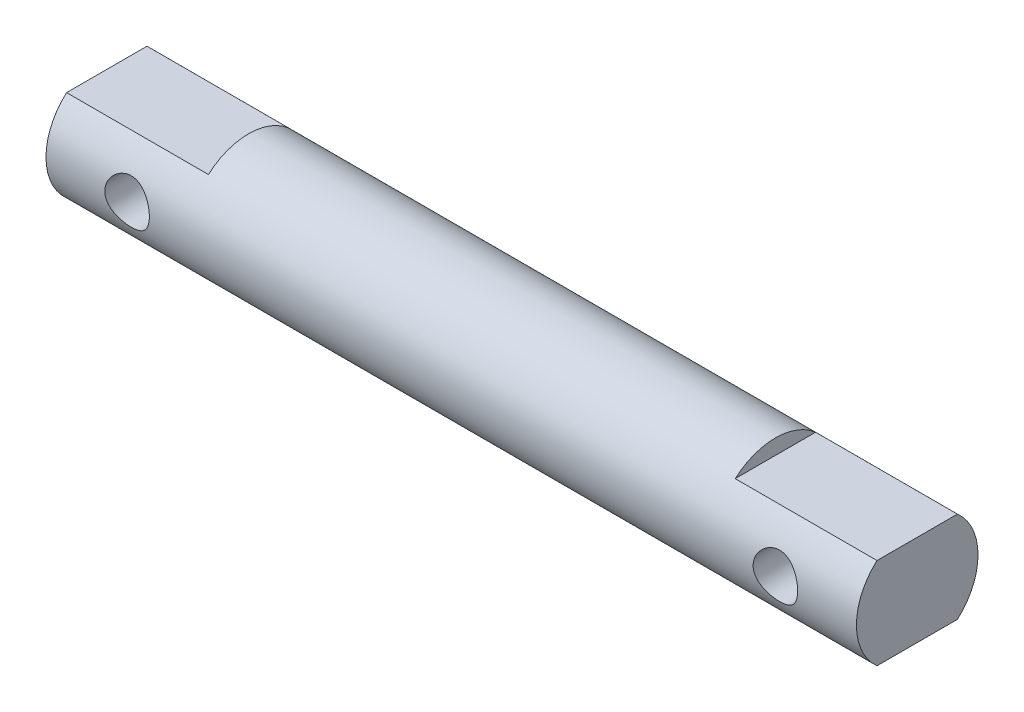
ISO-10303-21;
HEADER;
FILE_DESCRIPTION(('STEP AP214'),'2;1');
FILE_NAME('part.step','',(''),(''),'','','');
FILE_SCHEMA(('AUTOMOTIVE_DESIGN { 1 0 10303 214 1 1 1 1 }'));
ENDSEC;
DATA;
#1=APPLICATION_CONTEXT('core data for automotive mechanical design processes');
#2=APPLICATION_PROTOCOL_DEFINITION('international standard','automotive_design',2000,#1);
#3=PRODUCT_CONTEXT('',#1,'mechanical');
#4=PRODUCT('Part','Part','',(#3));
#5=PRODUCT_RELATED_PRODUCT_CATEGORY('part','',(#4));
#6=PRODUCT_DEFINITION_FORMATION('','',#4);
#7=PRODUCT_DEFINITION_CONTEXT('part definition',#1,'design');
#8=PRODUCT_DEFINITION('design','',#6,#7);
#9=PRODUCT_DEFINITION_SHAPE('','',#8);
#10=(LENGTH_UNIT() NAMED_UNIT(*) SI_UNIT(.MILLI.,.METRE.));
#11=(NAMED_UNIT(*) PLANE_ANGLE_UNIT() SI_UNIT($,.RADIAN.));
#12=(NAMED_UNIT(*) SI_UNIT($,.STERADIAN.) SOLID_ANGLE_UNIT());
#13=UNCERTAINTY_MEASURE_WITH_UNIT(LENGTH_MEASURE(1.E-05),#10,'distance_accuracy_value','');
#14=(GEOMETRIC_REPRESENTATION_CONTEXT(3) GLOBAL_UNCERTAINTY_ASSIGNED_CONTEXT((#13)) GLOBAL_UNIT_ASSIGNED_CONTEXT((#10,
#11,#12)) REPRESENTATION_CONTEXT('',''));
#15=CARTESIAN_POINT('',(0.,0.,0.));
#16=DIRECTION('',(0.,0.,1.));
#17=DIRECTION('',(1.,0.,0.));
#18=AXIS2_PLACEMENT_3D('',#15,#16,#17);
#19=CARTESIAN_POINT('',(-20.,3.,0.));
#20=DIRECTION('',(1.,0.,0.));
#21=DIRECTION('',(0.,0.,-1.));
#22=AXIS2_PLACEMENT_3D('',#19,#20,#21);
#23=PLANE('',#22);
#24=CARTESIAN_POINT('',(-20.,0.,0.));
#25=DIRECTION('',(-1.,0.,0.));
#26=DIRECTION('',(0.,0.,1.));
#27=AXIS2_PLACEMENT_3D('',#24,#25,#26);
#28=CIRCLE('',#27,3.);
#29=CARTESIAN_POINT('',(-20.,2.25,-1.98431348329845));
#30=VERTEX_POINT('',#29);
#31=CARTESIAN_POINT('',(-20.,-2.25,-1.98431348329845));
#32=VERTEX_POINT('',#31);
#33=EDGE_CURVE('E176',#30,#32,#28,.T.);
#34=ORIENTED_EDGE('',*,*,#33,.T.);
#35=DIRECTION('',(0.,0.,1.));
#36=VECTOR('',#35,1.);
#37=CARTESIAN_POINT('',(-20.,-2.25,-3.));
#38=LINE('',#37,#36);
#39=CARTESIAN_POINT('',(-20.,-2.25,1.98431348329845));
#40=VERTEX_POINT('',#39);
#41=EDGE_CURVE('E177',#32,#40,#38,.T.);
#42=ORIENTED_EDGE('',*,*,#41,.T.);
#43=CARTESIAN_POINT('',(-20.,2.25,1.98431348329845));
#44=VERTEX_POINT('',#43);
#45=EDGE_CURVE('E185',#40,#44,#28,.T.);
#46=ORIENTED_EDGE('',*,*,#45,.T.);
#47=DIRECTION('',(0.,0.,1.));
#48=VECTOR('',#47,1.);
#49=CARTESIAN_POINT('',(-20.,2.25,-3.));
#50=LINE('',#49,#48);
#51=EDGE_CURVE('E180',#30,#44,#50,.T.);
#52=ORIENTED_EDGE('',*,*,#51,.F.);
#53=EDGE_LOOP('',(#34,#42,#46,#52));
#54=FACE_BOUND('',#53,.T.);
#55=ADVANCED_FACE('F31',(#54),#23,.F.);
#56=CARTESIAN_POINT('',(20.,3.,0.));
#57=DIRECTION('',(-1.,0.,0.));
#58=DIRECTION('',(0.,0.,1.));
#59=AXIS2_PLACEMENT_3D('',#56,#57,#58);
#60=PLANE('',#59);
#61=CARTESIAN_POINT('',(20.,0.,0.));
#62=DIRECTION('',(-1.,0.,0.));
#63=DIRECTION('',(0.,0.,1.));
#64=AXIS2_PLACEMENT_3D('',#61,#62,#63);
#65=CIRCLE('',#64,3.);
#66=CARTESIAN_POINT('',(20.,-2.25,1.98431348329845));
#67=VERTEX_POINT('',#66);
#68=CARTESIAN_POINT('',(20.,2.25,1.98431348329845));
#69=VERTEX_POINT('',#68);
#70=EDGE_CURVE('E184',#67,#69,#65,.T.);
#71=ORIENTED_EDGE('',*,*,#70,.F.);
#72=DIRECTION('',(0.,0.,1.));
#73=VECTOR('',#72,1.);
#74=CARTESIAN_POINT('',(20.,-2.24999999999999,-3.));
#75=LINE('',#74,#73);
#76=CARTESIAN_POINT('',(20.,-2.24999999999999,-1.98431348329845));
#77=VERTEX_POINT('',#76);
#78=EDGE_CURVE('E49',#77,#67,#75,.T.);
#79=ORIENTED_EDGE('',*,*,#78,.F.);
#80=CARTESIAN_POINT('',(20.,2.25,-1.98431348329845));
#81=VERTEX_POINT('',#80);
#82=EDGE_CURVE('E115',#81,#77,#65,.T.);
#83=ORIENTED_EDGE('',*,*,#82,.F.);
#84=DIRECTION('',(0.,0.,1.));
#85=VECTOR('',#84,1.);
#86=CARTESIAN_POINT('',(20.,2.25,-3.));
#87=LINE('',#86,#85);
#88=EDGE_CURVE('E57',#81,#69,#87,.T.);
#89=ORIENTED_EDGE('',*,*,#88,.T.);
#90=EDGE_LOOP('',(#71,#79,#83,#89));
#91=FACE_BOUND('',#90,.T.);
#92=ADVANCED_FACE('F166',(#91),#60,.F.);
#93=CARTESIAN_POINT('',(0.,0.,0.));
#94=DIRECTION('',(-1.,0.,0.));
#95=DIRECTION('',(0.,0.,1.));
#96=AXIS2_PLACEMENT_3D('',#93,#94,#95);
#97=CYLINDRICAL_SURFACE('',#96,3.);
#98=CARTESIAN_POINT('',(17.1,0.,-3.));
#99=CARTESIAN_POINT('',(17.1000016959377,0.0596653603658475,-3.00000124874777));
#100=CARTESIAN_POINT('',(17.0951301942859,0.119318861047392,-2.99820433362878));
#101=CARTESIAN_POINT('',(17.0758476944229,0.236848244255451,-2.99121508676533));
#102=CARTESIAN_POINT('',(17.0614376008315,0.294724294806991,-2.98602307700504));
#103=CARTESIAN_POINT('',(17.0236525816176,0.40698713855009,-2.97280239953096));
#104=CARTESIAN_POINT('',(17.0002944784406,0.461380257103498,-2.96477905699958));
#105=CARTESIAN_POINT('',(16.9453600789518,0.56547335680578,-2.94669890184719));
#106=CARTESIAN_POINT('',(16.9137816850185,0.615172135653516,-2.93664157034718));
#107=CARTESIAN_POINT('',(16.8419533651427,0.710497168894281,-2.91507648167801));
#108=CARTESIAN_POINT('',(16.8014267972003,0.75590589164363,-2.90352893596448));
#109=CARTESIAN_POINT('',(16.7134398983826,0.839455790057789,-2.88048533673688));
#110=CARTESIAN_POINT('',(16.6659775853424,0.877594880931809,-2.86898929891451));
#111=CARTESIAN_POINT('',(16.563376148578,0.946876023491567,-2.84689276879725));
#112=CARTESIAN_POINT('',(16.5080218172978,0.977715943844815,-2.83633955824423));
#113=CARTESIAN_POINT('',(16.3924637493466,1.02955228614908,-2.81793972857027));
#114=CARTESIAN_POINT('',(16.3322618630331,1.0505524433536,-2.81009208269453));
#115=CARTESIAN_POINT('',(16.2112164474398,1.0812631510737,-2.798415961319));
#116=CARTESIAN_POINT('',(16.1504925023863,1.09138742706648,-2.79444077822037));
#117=CARTESIAN_POINT('',(16.0280875242816,1.10135267987145,-2.7905293041686));
#118=CARTESIAN_POINT('',(15.9664068739079,1.10119766744092,-2.79059143794103));
#119=CARTESIAN_POINT('',(15.8475684309638,1.09092609853663,-2.7946206462547));
#120=CARTESIAN_POINT('',(15.7903527714323,1.08137599754645,-2.79836566494697));
#121=CARTESIAN_POINT('',(15.6784010781988,1.05351920552002,-2.80897082219962));
#122=CARTESIAN_POINT('',(15.6236654025675,1.03521125437041,-2.81583140903281));
#123=CARTESIAN_POINT('',(15.5170456833763,0.990035328733108,-2.8320333504401));
#124=CARTESIAN_POINT('',(15.4652325623985,0.963016175829746,-2.84141799234525));
#125=CARTESIAN_POINT('',(15.3667082597295,0.901290064724288,-2.86159544268106));
#126=CARTESIAN_POINT('',(15.3199987915719,0.86658053627602,-2.87238872140381));
#127=CARTESIAN_POINT('',(15.2298618065168,0.78784062113783,-2.89501075010137));
#128=CARTESIAN_POINT('',(15.1868359200932,0.743355730941568,-2.90686155110834));
#129=CARTESIAN_POINT('',(15.1087384983429,0.647663117597076,-2.92966708861006));
#130=CARTESIAN_POINT('',(15.0736680803958,0.596454451658584,-2.94062169909304));
#131=CARTESIAN_POINT('',(15.0120600315232,0.487779773000808,-2.96060161705553));
#132=CARTESIAN_POINT('',(14.9856506658485,0.430235217521433,-2.96959731294347));
#133=CARTESIAN_POINT('',(14.9430190273705,0.311108672774422,-2.98442731277654));
#134=CARTESIAN_POINT('',(14.9267924370579,0.249528406901529,-2.99026295644358));
#135=CARTESIAN_POINT('',(14.9057463597197,0.127462862761649,-2.99788264484015));
#136=CARTESIAN_POINT('',(14.900385667251,0.0670827891130063,-2.99985872688891));
#137=CARTESIAN_POINT('',(14.8996547992509,-0.0537391869774858,-3.0001264355405));
#138=CARTESIAN_POINT('',(14.9042825233452,-0.114181073749809,-2.99841883675149));
#139=CARTESIAN_POINT('',(14.9229819168092,-0.231108406159618,-2.99163788470485));
#140=CARTESIAN_POINT('',(14.9367037311999,-0.287657784812599,-2.98668929450055));
#141=CARTESIAN_POINT('',(14.9727460210941,-0.397615636671328,-2.97404894323754));
#142=CARTESIAN_POINT('',(14.9950676153823,-0.451023700166589,-2.96635682527047));
#143=CARTESIAN_POINT('',(15.0483784353486,-0.554908427976737,-2.94871738617956));
#144=CARTESIAN_POINT('',(15.0795992520196,-0.605255980194477,-2.93871137811358));
#145=CARTESIAN_POINT('',(15.1495585567129,-0.700162701835578,-2.91755723487566));
#146=CARTESIAN_POINT('',(15.188299730741,-0.744719793590156,-2.90640869230438));
#147=CARTESIAN_POINT('',(15.274729050306,-0.829360890855199,-2.88343377289124));
#148=CARTESIAN_POINT('',(15.322794023905,-0.869060195620299,-2.87160406892303));
#149=CARTESIAN_POINT('',(15.4251419979686,-0.939899669781492,-2.84920568198054));
#150=CARTESIAN_POINT('',(15.4794254299312,-0.971039244708762,-2.83863708661841));
#151=CARTESIAN_POINT('',(15.5930149486137,-1.02386254843664,-2.8200170700311));
#152=CARTESIAN_POINT('',(15.6523338404576,-1.04552125182698,-2.81197232633534));
#153=CARTESIAN_POINT('',(15.7741515392404,-1.0784092993252,-2.79952649364981));
#154=CARTESIAN_POINT('',(15.8366484733941,-1.08964471233036,-2.79512328456104));
#155=CARTESIAN_POINT('',(15.9589005440155,-1.10083806784982,-2.79073255817453));
#156=CARTESIAN_POINT('',(16.0185873167862,-1.1014482886697,-2.79048965654101));
#157=CARTESIAN_POINT('',(16.1371646200869,-1.09303145247646,-2.7937971077441));
#158=CARTESIAN_POINT('',(16.1960552190201,-1.0840052287752,-2.79734713258729));
#159=CARTESIAN_POINT('',(16.3097076343864,-1.05707078841707,-2.80763225279226));
#160=CARTESIAN_POINT('',(16.3645387880301,-1.03941724094369,-2.81427578061567));
#161=CARTESIAN_POINT('',(16.4704956611847,-0.995949426173609,-2.82994981114228));
#162=CARTESIAN_POINT('',(16.5216204604584,-0.970133140652863,-2.83898090407659));
#163=CARTESIAN_POINT('',(16.62153059325,-0.909551414968637,-2.85898260515673));
#164=CARTESIAN_POINT('',(16.6700657713279,-0.874398504847364,-2.87002834990345));
#165=CARTESIAN_POINT('',(16.7607572977932,-0.796752399809456,-2.89254526375225));
#166=CARTESIAN_POINT('',(16.8029116572399,-0.75425692497287,-2.90401656412106));
#167=CARTESIAN_POINT('',(16.8818239918814,-0.660548639786973,-2.92679216754413));
#168=CARTESIAN_POINT('',(16.9181989614741,-0.609002616112059,-2.93805837226636));
#169=CARTESIAN_POINT('',(16.9817509381987,-0.500136860580023,-2.95853467976325));
#170=CARTESIAN_POINT('',(17.00892790779,-0.44281710515934,-2.96774477414609));
#171=CARTESIAN_POINT('',(17.0536679906505,-0.322493606369644,-2.9832468592136));
#172=CARTESIAN_POINT('',(17.0709760902518,-0.259384186418022,-2.9894608548018));
#173=CARTESIAN_POINT('',(17.0941386087502,-0.130844392872351,-2.99783583601898));
#174=CARTESIAN_POINT('',(17.0999981406317,-0.0654150686575986,-2.99999863091548));
#175=CARTESIAN_POINT('',(17.1,0.,-3.));
#176=B_SPLINE_CURVE_WITH_KNOTS('',3,(#98,#99,#100,#101,#102,#103,#104,#105,#106,#107,#108,#109,
#110,#111,#112,#113,#114,#115,#116,#117,#118,#119,#120,#121,#122,#123,#124,#125,#126,#127,#128,
#129,#130,#131,#132,#133,#134,#135,#136,#137,#138,#139,#140,#141,#142,#143,#144,#145,#146,#147,
#148,#149,#150,#151,#152,#153,#154,#155,#156,#157,#158,#159,#160,#161,#162,#163,#164,#165,#166,
#167,#168,#169,#170,#171,#172,#173,#174,#175),.UNSPECIFIED.,.T.,.F.,(4,2,2,2,2,2,2,2,2,2,2,2,2,
2,2,2,2,2,2,2,2,2,2,2,2,2,2,2,2,2,2,2,2,2,2,2,2,2,4),(0.,0.178754907739739,0.357492865169349,
0.535896427659754,0.714345559175,0.899369895863449,1.08444721440599,1.27620269157261,
1.46788531772088,1.65198550181501,1.83601385439912,2.00958682077848,2.18318476902303,
2.35997410918524,2.53682262453215,2.72499447820699,2.91319274508038,3.10406398185192,
3.29485423420864,3.47588192225445,3.65687154732447,3.83127381950643,4.00569878814084,
4.18515848390998,4.36468239466833,4.55415458027959,4.74363992131372,4.93362244947295,
5.12349429191199,5.3016658147168,5.4798219313811,5.65301061537201,5.82624215351945,
6.00825949460879,6.190333455313,6.38165835431486,6.57298403417707,6.76905241099166,
6.96503320271031),.UNSPECIFIED.);
#177=CARTESIAN_POINT('',(17.1,0.,-3.));
#178=VERTEX_POINT('',#177);
#179=EDGE_CURVE('E11',#178,#178,#176,.T.);
#180=ORIENTED_EDGE('',*,*,#179,.T.);
#181=EDGE_LOOP('',(#180));
#182=FACE_BOUND('',#181,.T.);
#183=CARTESIAN_POINT('',(17.1,0.,3.));
#184=CARTESIAN_POINT('',(17.1000016959377,-0.0596653603658475,3.00000124874777));
#185=CARTESIAN_POINT('',(17.0951301942859,-0.119318861047392,2.99820433362878));
#186=CARTESIAN_POINT('',(17.0758476944229,-0.236848244255451,2.99121508676533));
#187=CARTESIAN_POINT('',(17.0614376008315,-0.294724294806991,2.98602307700504));
#188=CARTESIAN_POINT('',(17.0236525816176,-0.40698713855009,2.97280239953096));
#189=CARTESIAN_POINT('',(17.0002944784406,-0.461380257103498,2.96477905699958));
#190=CARTESIAN_POINT('',(16.9453600789518,-0.56547335680578,2.94669890184719));
#191=CARTESIAN_POINT('',(16.9137816850185,-0.615172135653516,2.93664157034718));
#192=CARTESIAN_POINT('',(16.8419533651427,-0.710497168894281,2.91507648167801));
#193=CARTESIAN_POINT('',(16.8014267972003,-0.75590589164363,2.90352893596448));
#194=CARTESIAN_POINT('',(16.7134398983826,-0.839455790057789,2.88048533673688));
#195=CARTESIAN_POINT('',(16.6659775853424,-0.877594880931809,2.86898929891451));
#196=CARTESIAN_POINT('',(16.563376148578,-0.946876023491567,2.84689276879725));
#197=CARTESIAN_POINT('',(16.5080218172978,-0.977715943844815,2.83633955824423));
#198=CARTESIAN_POINT('',(16.3924637493466,-1.02955228614908,2.81793972857027));
#199=CARTESIAN_POINT('',(16.3322618630331,-1.0505524433536,2.81009208269453));
#200=CARTESIAN_POINT('',(16.2112164474398,-1.0812631510737,2.798415961319));
#201=CARTESIAN_POINT('',(16.1504925023863,-1.09138742706648,2.79444077822037));
#202=CARTESIAN_POINT('',(16.0280875242816,-1.10135267987145,2.7905293041686));
#203=CARTESIAN_POINT('',(15.9664068739079,-1.10119766744092,2.79059143794103));
#204=CARTESIAN_POINT('',(15.8475684309638,-1.09092609853663,2.7946206462547));
#205=CARTESIAN_POINT('',(15.7903527714323,-1.08137599754645,2.79836566494697));
#206=CARTESIAN_POINT('',(15.6784010781988,-1.05351920552002,2.80897082219962));
#207=CARTESIAN_POINT('',(15.6236654025675,-1.03521125437041,2.81583140903281));
#208=CARTESIAN_POINT('',(15.5170456833763,-0.990035328733108,2.8320333504401));
#209=CARTESIAN_POINT('',(15.4652325623985,-0.963016175829746,2.84141799234525));
#210=CARTESIAN_POINT('',(15.3667082597295,-0.901290064724288,2.86159544268106));
#211=CARTESIAN_POINT('',(15.3199987915719,-0.86658053627602,2.87238872140381));
#212=CARTESIAN_POINT('',(15.2298618065168,-0.78784062113783,2.89501075010137));
#213=CARTESIAN_POINT('',(15.1868359200932,-0.743355730941568,2.90686155110834));
#214=CARTESIAN_POINT('',(15.1087384983429,-0.647663117597076,2.92966708861006));
#215=CARTESIAN_POINT('',(15.0736680803958,-0.596454451658584,2.94062169909304));
#216=CARTESIAN_POINT('',(15.0120600315232,-0.487779773000808,2.96060161705553));
#217=CARTESIAN_POINT('',(14.9856506658485,-0.430235217521433,2.96959731294347));
#218=CARTESIAN_POINT('',(14.9430190273705,-0.311108672774422,2.98442731277654));
#219=CARTESIAN_POINT('',(14.9267924370579,-0.249528406901529,2.99026295644358));
#220=CARTESIAN_POINT('',(14.9057463597197,-0.127462862761649,2.99788264484015));
#221=CARTESIAN_POINT('',(14.900385667251,-0.0670827891130063,2.99985872688891));
#222=CARTESIAN_POINT('',(14.8996547992509,0.0537391869774858,3.0001264355405));
#223=CARTESIAN_POINT('',(14.9042825233452,0.114181073749809,2.99841883675149));
#224=CARTESIAN_POINT('',(14.9229819168092,0.231108406159618,2.99163788470485));
#225=CARTESIAN_POINT('',(14.9367037311999,0.287657784812599,2.98668929450055));
#226=CARTESIAN_POINT('',(14.9727460210941,0.397615636671328,2.97404894323754));
#227=CARTESIAN_POINT('',(14.9950676153823,0.451023700166589,2.96635682527047));
#228=CARTESIAN_POINT('',(15.0483784353486,0.554908427976737,2.94871738617956));
#229=CARTESIAN_POINT('',(15.0795992520196,0.605255980194477,2.93871137811358));
#230=CARTESIAN_POINT('',(15.1495585567129,0.700162701835578,2.91755723487566));
#231=CARTESIAN_POINT('',(15.188299730741,0.744719793590156,2.90640869230438));
#232=CARTESIAN_POINT('',(15.274729050306,0.829360890855199,2.88343377289124));
#233=CARTESIAN_POINT('',(15.322794023905,0.869060195620299,2.87160406892303));
#234=CARTESIAN_POINT('',(15.4251419979686,0.939899669781492,2.84920568198054));
#235=CARTESIAN_POINT('',(15.4794254299312,0.971039244708762,2.83863708661841));
#236=CARTESIAN_POINT('',(15.5930149486137,1.02386254843664,2.8200170700311));
#237=CARTESIAN_POINT('',(15.6523338404576,1.04552125182698,2.81197232633534));
#238=CARTESIAN_POINT('',(15.7741515392404,1.0784092993252,2.79952649364981));
#239=CARTESIAN_POINT('',(15.8366484733941,1.08964471233036,2.79512328456104));
#240=CARTESIAN_POINT('',(15.9589005440155,1.10083806784982,2.79073255817453));
#241=CARTESIAN_POINT('',(16.0185873167862,1.1014482886697,2.79048965654101));
#242=CARTESIAN_POINT('',(16.1371646200869,1.09303145247646,2.7937971077441));
#243=CARTESIAN_POINT('',(16.1960552190201,1.0840052287752,2.79734713258729));
#244=CARTESIAN_POINT('',(16.3097076343864,1.05707078841707,2.80763225279226));
#245=CARTESIAN_POINT('',(16.3645387880301,1.03941724094369,2.81427578061567));
#246=CARTESIAN_POINT('',(16.4704956611847,0.995949426173609,2.82994981114228));
#247=CARTESIAN_POINT('',(16.5216204604584,0.970133140652863,2.83898090407659));
#248=CARTESIAN_POINT('',(16.62153059325,0.909551414968637,2.85898260515673));
#249=CARTESIAN_POINT('',(16.6700657713279,0.874398504847364,2.87002834990345));
#250=CARTESIAN_POINT('',(16.7607572977932,0.796752399809456,2.89254526375225));
#251=CARTESIAN_POINT('',(16.8029116572399,0.75425692497287,2.90401656412106));
#252=CARTESIAN_POINT('',(16.8818239918814,0.660548639786973,2.92679216754413));
#253=CARTESIAN_POINT('',(16.9181989614741,0.609002616112059,2.93805837226636));
#254=CARTESIAN_POINT('',(16.9817509381987,0.500136860580023,2.95853467976325));
#255=CARTESIAN_POINT('',(17.00892790779,0.44281710515934,2.96774477414609));
#256=CARTESIAN_POINT('',(17.0536679906505,0.322493606369644,2.9832468592136));
#257=CARTESIAN_POINT('',(17.0709760902518,0.259384186418022,2.9894608548018));
#258=CARTESIAN_POINT('',(17.0941386087502,0.130844392872351,2.99783583601898));
#259=CARTESIAN_POINT('',(17.0999981406317,0.0654150686575986,2.99999863091548));
#260=CARTESIAN_POINT('',(17.1,0.,3.));
#261=B_SPLINE_CURVE_WITH_KNOTS('',3,(#183,#184,#185,#186,#187,#188,#189,#190,#191,#192,#193,
#194,#195,#196,#197,#198,#199,#200,#201,#202,#203,#204,#205,#206,#207,#208,#209,#210,#211,#212,
#213,#214,#215,#216,#217,#218,#219,#220,#221,#222,#223,#224,#225,#226,#227,#228,#229,#230,#231,
#232,#233,#234,#235,#236,#237,#238,#239,#240,#241,#242,#243,#244,#245,#246,#247,#248,#249,#250,
#251,#252,#253,#254,#255,#256,#257,#258,#259,#260),.UNSPECIFIED.,.T.,.F.,(4,2,2,2,2,2,2,2,2,2,2,
2,2,2,2,2,2,2,2,2,2,2,2,2,2,2,2,2,2,2,2,2,2,2,2,2,2,2,4),(0.,0.178754907739739,
0.357492865169349,0.535896427659754,0.714345559175,0.899369895863449,1.08444721440599,
1.27620269157261,1.46788531772088,1.65198550181501,1.83601385439912,2.00958682077848,
2.18318476902303,2.35997410918524,2.53682262453215,2.72499447820699,2.91319274508038,
3.10406398185192,3.29485423420864,3.47588192225445,3.65687154732447,3.83127381950643,
4.00569878814084,4.18515848390998,4.36468239466833,4.55415458027959,4.74363992131372,
4.93362244947295,5.12349429191199,5.3016658147168,5.4798219313811,5.65301061537201,
5.82624215351945,6.00825949460879,6.190333455313,6.38165835431486,6.57298403417707,
6.76905241099166,6.96503320271031),.UNSPECIFIED.);
#262=CARTESIAN_POINT('',(17.1,0.,3.));
#263=VERTEX_POINT('',#262);
#264=EDGE_CURVE('E42',#263,#263,#261,.T.);
#265=ORIENTED_EDGE('',*,*,#264,.T.);
#266=EDGE_LOOP('',(#265));
#267=FACE_BOUND('',#266,.T.);
#268=CARTESIAN_POINT('',(-14.9,0.,-3.));
#269=CARTESIAN_POINT('',(-14.8999983040623,0.0596653603658478,-3.00000124874777));
#270=CARTESIAN_POINT('',(-14.9048698057141,0.119318861047392,-2.99820433362878));
#271=CARTESIAN_POINT('',(-14.9241523055771,0.236848244255451,-2.99121508676533));
#272=CARTESIAN_POINT('',(-14.9385623991685,0.294724294806991,-2.98602307700504));
#273=CARTESIAN_POINT('',(-14.9763474183824,0.40698713855009,-2.97280239953095));
#274=CARTESIAN_POINT('',(-14.9997055215594,0.461380257103499,-2.96477905699958));
#275=CARTESIAN_POINT('',(-15.0546399210482,0.56547335680578,-2.94669890184719));
#276=CARTESIAN_POINT('',(-15.0862183149815,0.615172135653517,-2.93664157034718));
#277=CARTESIAN_POINT('',(-15.1580466348573,0.710497168894281,-2.91507648167801));
#278=CARTESIAN_POINT('',(-15.1985732027997,0.755905891643631,-2.90352893596448));
#279=CARTESIAN_POINT('',(-15.2865601016174,0.839455790057789,-2.88048533673688));
#280=CARTESIAN_POINT('',(-15.3340224146576,0.877594880931809,-2.86898929891451));
#281=CARTESIAN_POINT('',(-15.436623851422,0.946876023491567,-2.84689276879725));
#282=CARTESIAN_POINT('',(-15.4919781827022,0.977715943844814,-2.83633955824423));
#283=CARTESIAN_POINT('',(-15.6075362506534,1.02955228614908,-2.81793972857028));
#284=CARTESIAN_POINT('',(-15.6677381369669,1.0505524433536,-2.81009208269453));
#285=CARTESIAN_POINT('',(-15.7887835525602,1.0812631510737,-2.798415961319));
#286=CARTESIAN_POINT('',(-15.8495074976137,1.09138742706649,-2.79444077822037));
#287=CARTESIAN_POINT('',(-15.9719124757184,1.10135267987145,-2.7905293041686));
#288=CARTESIAN_POINT('',(-16.0335931260921,1.10119766744092,-2.79059143794103));
#289=CARTESIAN_POINT('',(-16.1524315690362,1.09092609853663,-2.7946206462547));
#290=CARTESIAN_POINT('',(-16.2096472285677,1.08137599754645,-2.79836566494697));
#291=CARTESIAN_POINT('',(-16.3215989218012,1.05351920552002,-2.80897082219962));
#292=CARTESIAN_POINT('',(-16.3763345974325,1.03521125437041,-2.81583140903281));
#293=CARTESIAN_POINT('',(-16.4829543166237,0.990035328733111,-2.8320333504401));
#294=CARTESIAN_POINT('',(-16.5347674376015,0.963016175829749,-2.84141799234525));
#295=CARTESIAN_POINT('',(-16.6332917402705,0.901290064724291,-2.86159544268106));
#296=CARTESIAN_POINT('',(-16.6800012084281,0.866580536276023,-2.87238872140381));
#297=CARTESIAN_POINT('',(-16.7701381934832,0.787840621137833,-2.89501075010137));
#298=CARTESIAN_POINT('',(-16.8131640799068,0.74335573094157,-2.90686155110834));
#299=CARTESIAN_POINT('',(-16.8912615016571,0.647663117597078,-2.92966708861006));
#300=CARTESIAN_POINT('',(-16.9263319196042,0.596454451658586,-2.94062169909304));
#301=CARTESIAN_POINT('',(-16.9879399684768,0.48777977300081,-2.96060161705553));
#302=CARTESIAN_POINT('',(-17.0143493341515,0.430235217521433,-2.96959731294347));
#303=CARTESIAN_POINT('',(-17.0569809726295,0.311108672774423,-2.98442731277654));
#304=CARTESIAN_POINT('',(-17.0732075629421,0.249528406901531,-2.99026295644358));
#305=CARTESIAN_POINT('',(-17.0942536402803,0.127462862761652,-2.99788264484015));
#306=CARTESIAN_POINT('',(-17.099614332749,0.0670827891130083,-2.99985872688891));
#307=CARTESIAN_POINT('',(-17.1003452007491,-0.0537391869774842,-3.0001264355405));
#308=CARTESIAN_POINT('',(-17.0957174766548,-0.114181073749807,-2.99841883675149));
#309=CARTESIAN_POINT('',(-17.0770180831908,-0.231108406159617,-2.99163788470485));
#310=CARTESIAN_POINT('',(-17.0632962688001,-0.287657784812599,-2.98668929450055));
#311=CARTESIAN_POINT('',(-17.0272539789059,-0.397615636671328,-2.97404894323754));
#312=CARTESIAN_POINT('',(-17.0049323846177,-0.451023700166588,-2.96635682527047));
#313=CARTESIAN_POINT('',(-16.9516215646514,-0.554908427976736,-2.94871738617956));
#314=CARTESIAN_POINT('',(-16.9204007479804,-0.605255980194477,-2.93871137811357));
#315=CARTESIAN_POINT('',(-16.8504414432871,-0.700162701835579,-2.91755723487566));
#316=CARTESIAN_POINT('',(-16.811700269259,-0.744719793590156,-2.90640869230438));
#317=CARTESIAN_POINT('',(-16.725270949694,-0.829360890855199,-2.88343377289124));
#318=CARTESIAN_POINT('',(-16.677205976095,-0.869060195620301,-2.87160406892303));
#319=CARTESIAN_POINT('',(-16.5748580020314,-0.939899669781493,-2.84920568198054));
#320=CARTESIAN_POINT('',(-16.5205745700688,-0.971039244708763,-2.83863708661841));
#321=CARTESIAN_POINT('',(-16.4069850513863,-1.02386254843665,-2.8200170700311));
#322=CARTESIAN_POINT('',(-16.3476661595424,-1.04552125182698,-2.81197232633534));
#323=CARTESIAN_POINT('',(-16.2258484607596,-1.0784092993252,-2.79952649364981));
#324=CARTESIAN_POINT('',(-16.1633515266059,-1.08964471233036,-2.79512328456104));
#325=CARTESIAN_POINT('',(-16.0410994559845,-1.10083806784982,-2.79073255817453));
#326=CARTESIAN_POINT('',(-15.9814126832138,-1.1014482886697,-2.79048965654101));
#327=CARTESIAN_POINT('',(-15.8628353799131,-1.09303145247646,-2.7937971077441));
#328=CARTESIAN_POINT('',(-15.8039447809799,-1.0840052287752,-2.79734713258729));
#329=CARTESIAN_POINT('',(-15.6902923656136,-1.05707078841707,-2.80763225279226));
#330=CARTESIAN_POINT('',(-15.6354612119699,-1.03941724094369,-2.81427578061567));
#331=CARTESIAN_POINT('',(-15.5295043388153,-0.995949426173611,-2.82994981114228));
#332=CARTESIAN_POINT('',(-15.4783795395416,-0.970133140652865,-2.83898090407659));
#333=CARTESIAN_POINT('',(-15.37846940675,-0.90955141496864,-2.85898260515673));
#334=CARTESIAN_POINT('',(-15.3299342286721,-0.874398504847367,-2.87002834990345));
#335=CARTESIAN_POINT('',(-15.2392427022068,-0.79675239980946,-2.89254526375225));
#336=CARTESIAN_POINT('',(-15.1970883427601,-0.754256924972873,-2.90401656412106));
#337=CARTESIAN_POINT('',(-15.1181760081186,-0.660548639786976,-2.92679216754413));
#338=CARTESIAN_POINT('',(-15.0818010385259,-0.609002616112063,-2.93805837226635));
#339=CARTESIAN_POINT('',(-15.0182490618013,-0.500136860580026,-2.95853467976325));
#340=CARTESIAN_POINT('',(-14.99107209221,-0.442817105159344,-2.96774477414609));
#341=CARTESIAN_POINT('',(-14.9463320093495,-0.322493606369647,-2.9832468592136));
#342=CARTESIAN_POINT('',(-14.9290239097482,-0.259384186418024,-2.9894608548018));
#343=CARTESIAN_POINT('',(-14.9058613912498,-0.130844392872352,-2.99783583601898));
#344=CARTESIAN_POINT('',(-14.9000018593683,-0.0654150686575992,-2.99999863091548));
#345=CARTESIAN_POINT('',(-14.9,0.,-3.));
#346=B_SPLINE_CURVE_WITH_KNOTS('',3,(#268,#269,#270,#271,#272,#273,#274,#275,#276,#277,#278,
#279,#280,#281,#282,#283,#284,#285,#286,#287,#288,#289,#290,#291,#292,#293,#294,#295,#296,#297,
#298,#299,#300,#301,#302,#303,#304,#305,#306,#307,#308,#309,#310,#311,#312,#313,#314,#315,#316,
#317,#318,#319,#320,#321,#322,#323,#324,#325,#326,#327,#328,#329,#330,#331,#332,#333,#334,#335,
#336,#337,#338,#339,#340,#341,#342,#343,#344,#345),.UNSPECIFIED.,.T.,.F.,(4,2,2,2,2,2,2,2,2,2,2,
2,2,2,2,2,2,2,2,2,2,2,2,2,2,2,2,2,2,2,2,2,2,2,2,2,2,2,4),(0.,0.178754907739739,
0.357492865169348,0.535896427659755,0.714345559175001,0.899369895863447,1.08444721440599,
1.2762026915726,1.46788531772088,1.65198550181501,1.83601385439912,2.00958682077848,
2.18318476902303,2.35997410918523,2.53682262453215,2.72499447820699,2.91319274508039,
3.10406398185192,3.29485423420864,3.47588192225445,3.65687154732447,3.83127381950643,
4.00569878814085,4.18515848390999,4.36468239466834,4.55415458027959,4.74363992131372,
4.93362244947296,5.123494291912,5.3016658147168,5.47982193138111,5.65301061537202,
5.82624215351945,6.00825949460879,6.19033345531301,6.38165835431487,6.57298403417708,
6.76905241099167,6.96503320271032),.UNSPECIFIED.);
#347=CARTESIAN_POINT('',(-14.9,0.,-3.));
#348=VERTEX_POINT('',#347);
#349=EDGE_CURVE('E119',#348,#348,#346,.T.);
#350=ORIENTED_EDGE('',*,*,#349,.T.);
#351=EDGE_LOOP('',(#350));
#352=FACE_BOUND('',#351,.T.);
#353=CARTESIAN_POINT('',(-14.9,0.,3.));
#354=CARTESIAN_POINT('',(-14.8999983040623,-0.0596653603658477,3.00000124874777));
#355=CARTESIAN_POINT('',(-14.9048698057141,-0.119318861047392,2.99820433362878));
#356=CARTESIAN_POINT('',(-14.9241523055771,-0.236848244255451,2.99121508676533));
#357=CARTESIAN_POINT('',(-14.9385623991685,-0.294724294806991,2.98602307700504));
#358=CARTESIAN_POINT('',(-14.9763474183824,-0.40698713855009,2.97280239953096));
#359=CARTESIAN_POINT('',(-14.9997055215594,-0.461380257103498,2.96477905699958));
#360=CARTESIAN_POINT('',(-15.0546399210482,-0.56547335680578,2.94669890184719));
#361=CARTESIAN_POINT('',(-15.0862183149815,-0.615172135653516,2.93664157034718));
#362=CARTESIAN_POINT('',(-15.1580466348573,-0.710497168894281,2.91507648167801));
#363=CARTESIAN_POINT('',(-15.1985732027997,-0.755905891643631,2.90352893596448));
#364=CARTESIAN_POINT('',(-15.2865601016174,-0.839455790057789,2.88048533673688));
#365=CARTESIAN_POINT('',(-15.3340224146576,-0.877594880931808,2.86898929891451));
#366=CARTESIAN_POINT('',(-15.436623851422,-0.946876023491567,2.84689276879725));
#367=CARTESIAN_POINT('',(-15.4919781827022,-0.977715943844815,2.83633955824423));
#368=CARTESIAN_POINT('',(-15.6075362506534,-1.02955228614908,2.81793972857027));
#369=CARTESIAN_POINT('',(-15.6677381369669,-1.0505524433536,2.81009208269453));
#370=CARTESIAN_POINT('',(-15.7887835525602,-1.0812631510737,2.798415961319));
#371=CARTESIAN_POINT('',(-15.8495074976137,-1.09138742706649,2.79444077822037));
#372=CARTESIAN_POINT('',(-15.9719124757184,-1.10135267987145,2.7905293041686));
#373=CARTESIAN_POINT('',(-16.0335931260921,-1.10119766744092,2.79059143794103));
#374=CARTESIAN_POINT('',(-16.1524315690362,-1.09092609853663,2.7946206462547));
#375=CARTESIAN_POINT('',(-16.2096472285677,-1.08137599754645,2.79836566494697));
#376=CARTESIAN_POINT('',(-16.3215989218012,-1.05351920552002,2.80897082219962));
#377=CARTESIAN_POINT('',(-16.3763345974325,-1.03521125437041,2.81583140903281));
#378=CARTESIAN_POINT('',(-16.4829543166237,-0.990035328733111,2.8320333504401));
#379=CARTESIAN_POINT('',(-16.5347674376015,-0.96301617582975,2.84141799234525));
#380=CARTESIAN_POINT('',(-16.6332917402705,-0.901290064724291,2.86159544268105));
#381=CARTESIAN_POINT('',(-16.6800012084281,-0.866580536276023,2.87238872140381));
#382=CARTESIAN_POINT('',(-16.7701381934832,-0.787840621137832,2.89501075010137));
#383=CARTESIAN_POINT('',(-16.8131640799068,-0.743355730941569,2.90686155110834));
#384=CARTESIAN_POINT('',(-16.8912615016571,-0.647663117597078,2.92966708861006));
#385=CARTESIAN_POINT('',(-16.9263319196042,-0.596454451658586,2.94062169909304));
#386=CARTESIAN_POINT('',(-16.9879399684768,-0.487779773000809,2.96060161705553));
#387=CARTESIAN_POINT('',(-17.0143493341515,-0.430235217521432,2.96959731294347));
#388=CARTESIAN_POINT('',(-17.0569809726295,-0.311108672774422,2.98442731277654));
#389=CARTESIAN_POINT('',(-17.0732075629421,-0.24952840690153,2.99026295644358));
#390=CARTESIAN_POINT('',(-17.0942536402803,-0.127462862761651,2.99788264484015));
#391=CARTESIAN_POINT('',(-17.099614332749,-0.0670827891130074,2.99985872688891));
#392=CARTESIAN_POINT('',(-17.1003452007491,0.0537391869774854,3.0001264355405));
#393=CARTESIAN_POINT('',(-17.0957174766548,0.114181073749808,2.99841883675149));
#394=CARTESIAN_POINT('',(-17.0770180831908,0.231108406159618,2.99163788470485));
#395=CARTESIAN_POINT('',(-17.0632962688001,0.287657784812599,2.98668929450055));
#396=CARTESIAN_POINT('',(-17.0272539789059,0.397615636671328,2.97404894323754));
#397=CARTESIAN_POINT('',(-17.0049323846177,0.451023700166589,2.96635682527047));
#398=CARTESIAN_POINT('',(-16.9516215646514,0.554908427976737,2.94871738617956));
#399=CARTESIAN_POINT('',(-16.9204007479804,0.605255980194477,2.93871137811357));
#400=CARTESIAN_POINT('',(-16.8504414432871,0.700162701835579,2.91755723487566));
#401=CARTESIAN_POINT('',(-16.811700269259,0.744719793590157,2.90640869230438));
#402=CARTESIAN_POINT('',(-16.725270949694,0.8293608908552,2.88343377289124));
#403=CARTESIAN_POINT('',(-16.677205976095,0.869060195620301,2.87160406892303));
#404=CARTESIAN_POINT('',(-16.5748580020314,0.939899669781493,2.84920568198054));
#405=CARTESIAN_POINT('',(-16.5205745700688,0.971039244708763,2.83863708661841));
#406=CARTESIAN_POINT('',(-16.4069850513863,1.02386254843665,2.8200170700311));
#407=CARTESIAN_POINT('',(-16.3476661595424,1.04552125182698,2.81197232633534));
#408=CARTESIAN_POINT('',(-16.2258484607596,1.0784092993252,2.79952649364981));
#409=CARTESIAN_POINT('',(-16.1633515266059,1.08964471233036,2.79512328456104));
#410=CARTESIAN_POINT('',(-16.0410994559845,1.10083806784982,2.79073255817453));
#411=CARTESIAN_POINT('',(-15.9814126832138,1.1014482886697,2.79048965654101));
#412=CARTESIAN_POINT('',(-15.8628353799131,1.09303145247646,2.7937971077441));
#413=CARTESIAN_POINT('',(-15.8039447809799,1.0840052287752,2.79734713258729));
#414=CARTESIAN_POINT('',(-15.6902923656136,1.05707078841707,2.80763225279226));
#415=CARTESIAN_POINT('',(-15.6354612119699,1.03941724094369,2.81427578061567));
#416=CARTESIAN_POINT('',(-15.5295043388153,0.995949426173611,2.82994981114228));
#417=CARTESIAN_POINT('',(-15.4783795395416,0.970133140652865,2.83898090407659));
#418=CARTESIAN_POINT('',(-15.37846940675,0.90955141496864,2.85898260515673));
#419=CARTESIAN_POINT('',(-15.3299342286721,0.874398504847367,2.87002834990345));
#420=CARTESIAN_POINT('',(-15.2392427022068,0.796752399809459,2.89254526375225));
#421=CARTESIAN_POINT('',(-15.1970883427601,0.754256924972873,2.90401656412106));
#422=CARTESIAN_POINT('',(-15.1181760081186,0.660548639786976,2.92679216754413));
#423=CARTESIAN_POINT('',(-15.0818010385259,0.609002616112063,2.93805837226635));
#424=CARTESIAN_POINT('',(-15.0182490618013,0.500136860580026,2.95853467976325));
#425=CARTESIAN_POINT('',(-14.99107209221,0.442817105159343,2.96774477414609));
#426=CARTESIAN_POINT('',(-14.9463320093495,0.322493606369647,2.9832468592136));
#427=CARTESIAN_POINT('',(-14.9290239097482,0.259384186418024,2.9894608548018));
#428=CARTESIAN_POINT('',(-14.9058613912498,0.130844392872352,2.99783583601898));
#429=CARTESIAN_POINT('',(-14.9000018593683,0.0654150686575993,2.99999863091548));
#430=CARTESIAN_POINT('',(-14.9,0.,3.));
#431=B_SPLINE_CURVE_WITH_KNOTS('',3,(#353,#354,#355,#356,#357,#358,#359,#360,#361,#362,#363,
#364,#365,#366,#367,#368,#369,#370,#371,#372,#373,#374,#375,#376,#377,#378,#379,#380,#381,#382,
#383,#384,#385,#386,#387,#388,#389,#390,#391,#392,#393,#394,#395,#396,#397,#398,#399,#400,#401,
#402,#403,#404,#405,#406,#407,#408,#409,#410,#411,#412,#413,#414,#415,#416,#417,#418,#419,#420,
#421,#422,#423,#424,#425,#426,#427,#428,#429,#430),.UNSPECIFIED.,.T.,.F.,(4,2,2,2,2,2,2,2,2,2,2,
2,2,2,2,2,2,2,2,2,2,2,2,2,2,2,2,2,2,2,2,2,2,2,2,2,2,2,4),(0.,0.178754907739739,
0.357492865169348,0.535896427659755,0.714345559175001,0.899369895863447,1.08444721440599,
1.27620269157261,1.46788531772088,1.65198550181501,1.83601385439912,2.00958682077848,
2.18318476902303,2.35997410918524,2.53682262453215,2.72499447820699,2.91319274508039,
3.10406398185192,3.29485423420864,3.47588192225445,3.65687154732447,3.83127381950643,
4.00569878814085,4.18515848390999,4.36468239466834,4.5541545802796,4.74363992131372,
4.93362244947297,5.123494291912,5.30166581471681,5.47982193138111,5.65301061537202,
5.82624215351946,6.00825949460879,6.19033345531301,6.38165835431487,6.57298403417708,
6.76905241099167,6.96503320271032),.UNSPECIFIED.);
#432=CARTESIAN_POINT('',(-14.9,0.,3.));
#433=VERTEX_POINT('',#432);
#434=EDGE_CURVE('E116',#433,#433,#431,.T.);
#435=ORIENTED_EDGE('',*,*,#434,.T.);
#436=EDGE_LOOP('',(#435));
#437=FACE_BOUND('',#436,.T.);
#438=ORIENTED_EDGE('',*,*,#45,.F.);
#439=DIRECTION('',(-1.,0.,0.));
#440=VECTOR('',#439,1.);
#441=CARTESIAN_POINT('',(0.,-2.25,1.98431348329845));
#442=LINE('',#441,#440);
#443=CARTESIAN_POINT('',(-13.,-2.25,1.98431348329844));
#444=VERTEX_POINT('',#443);
#445=EDGE_CURVE('E204',#40,#444,#442,.F.);
#446=ORIENTED_EDGE('',*,*,#445,.T.);
#447=CARTESIAN_POINT('',(-13.,0.,0.));
#448=DIRECTION('',(1.,0.,0.));
#449=DIRECTION('',(0.,0.,-1.));
#450=AXIS2_PLACEMENT_3D('',#447,#448,#449);
#451=CIRCLE('',#450,3.);
#452=CARTESIAN_POINT('',(-13.,-2.25,-1.98431348329844));
#453=VERTEX_POINT('',#452);
#454=EDGE_CURVE('E199',#444,#453,#451,.T.);
#455=ORIENTED_EDGE('',*,*,#454,.T.);
#456=DIRECTION('',(-1.,0.,0.));
#457=VECTOR('',#456,1.);
#458=CARTESIAN_POINT('',(0.,-2.25,-1.98431348329845));
#459=LINE('',#458,#457);
#460=EDGE_CURVE('E202',#453,#32,#459,.T.);
#461=ORIENTED_EDGE('',*,*,#460,.T.);
#462=ORIENTED_EDGE('',*,*,#33,.F.);
#463=DIRECTION('',(-1.,0.,0.));
#464=VECTOR('',#463,1.);
#465=CARTESIAN_POINT('',(0.,2.25,-1.98431348329845));
#466=LINE('',#465,#464);
#467=CARTESIAN_POINT('',(-13.,2.25,-1.98431348329845));
#468=VERTEX_POINT('',#467);
#469=EDGE_CURVE('E192',#30,#468,#466,.F.);
#470=ORIENTED_EDGE('',*,*,#469,.T.);
#471=CARTESIAN_POINT('',(-13.,0.,0.));
#472=DIRECTION('',(1.,0.,0.));
#473=DIRECTION('',(0.,0.,-1.));
#474=AXIS2_PLACEMENT_3D('',#471,#472,#473);
#475=CIRCLE('',#474,3.);
#476=CARTESIAN_POINT('',(-13.,2.25,1.98431348329845));
#477=VERTEX_POINT('',#476);
#478=EDGE_CURVE('E194',#468,#477,#475,.T.);
#479=ORIENTED_EDGE('',*,*,#478,.T.);
#480=DIRECTION('',(-1.,0.,0.));
#481=VECTOR('',#480,1.);
#482=CARTESIAN_POINT('',(0.,2.25,1.98431348329845));
#483=LINE('',#482,#481);
#484=EDGE_CURVE('E196',#477,#44,#483,.T.);
#485=ORIENTED_EDGE('',*,*,#484,.T.);
#486=EDGE_LOOP('',(#438,#446,#455,#461,#462,#470,#479,#485));
#487=FACE_BOUND('',#486,.T.);
#488=DIRECTION('',(-1.,0.,0.));
#489=VECTOR('',#488,1.);
#490=CARTESIAN_POINT('',(0.,-2.25,-1.98431348329845));
#491=LINE('',#490,#489);
#492=CARTESIAN_POINT('',(13.,-2.24999999999999,-1.98431348329845));
#493=VERTEX_POINT('',#492);
#494=EDGE_CURVE('E106',#77,#493,#491,.T.);
#495=ORIENTED_EDGE('',*,*,#494,.T.);
#496=CARTESIAN_POINT('',(13.,0.,0.));
#497=DIRECTION('',(-1.,0.,0.));
#498=DIRECTION('',(0.,-1.,0.));
#499=AXIS2_PLACEMENT_3D('',#496,#497,#498);
#500=CIRCLE('',#499,3.);
#501=CARTESIAN_POINT('',(13.,-2.24999999999999,1.98431348329845));
#502=VERTEX_POINT('',#501);
#503=EDGE_CURVE('E100',#493,#502,#500,.T.);
#504=ORIENTED_EDGE('',*,*,#503,.T.);
#505=DIRECTION('',(-1.,0.,0.));
#506=VECTOR('',#505,1.);
#507=CARTESIAN_POINT('',(0.,-2.25,1.98431348329845));
#508=LINE('',#507,#506);
#509=EDGE_CURVE('E107',#502,#67,#508,.F.);
#510=ORIENTED_EDGE('',*,*,#509,.T.);
#511=ORIENTED_EDGE('',*,*,#70,.T.);
#512=DIRECTION('',(-1.,0.,0.));
#513=VECTOR('',#512,1.);
#514=CARTESIAN_POINT('',(0.,2.25,1.98431348329845));
#515=LINE('',#514,#513);
#516=CARTESIAN_POINT('',(13.,2.25,1.98431348329845));
#517=VERTEX_POINT('',#516);
#518=EDGE_CURVE('E212',#69,#517,#515,.T.);
#519=ORIENTED_EDGE('',*,*,#518,.T.);
#520=CARTESIAN_POINT('',(13.,0.,0.));
#521=DIRECTION('',(-1.,0.,0.));
#522=DIRECTION('',(0.,0.,1.));
#523=AXIS2_PLACEMENT_3D('',#520,#521,#522);
#524=CIRCLE('',#523,3.);
#525=CARTESIAN_POINT('',(13.,2.25,-1.98431348329845));
#526=VERTEX_POINT('',#525);
#527=EDGE_CURVE('E209',#517,#526,#524,.T.);
#528=ORIENTED_EDGE('',*,*,#527,.T.);
#529=DIRECTION('',(-1.,0.,0.));
#530=VECTOR('',#529,1.);
#531=CARTESIAN_POINT('',(0.,2.25,-1.98431348329845));
#532=LINE('',#531,#530);
#533=EDGE_CURVE('E207',#526,#81,#532,.F.);
#534=ORIENTED_EDGE('',*,*,#533,.T.);
#535=ORIENTED_EDGE('',*,*,#82,.T.);
#536=EDGE_LOOP('',(#495,#504,#510,#511,#519,#528,#534,#535));
#537=FACE_BOUND('',#536,.T.);
#538=ADVANCED_FACE('F113',(#182,#267,#352,#437,#487,#537),#97,.T.);
#539=CARTESIAN_POINT('',(-13.,3.,-3.));
#540=DIRECTION('',(1.,0.,0.));
#541=DIRECTION('',(0.,0.,-1.));
#542=AXIS2_PLACEMENT_3D('',#539,#540,#541);
#543=PLANE('',#542);
#544=DIRECTION('',(0.,0.,1.));
#545=VECTOR('',#544,1.);
#546=CARTESIAN_POINT('',(-13.,2.25,-3.));
#547=LINE('',#546,#545);
#548=EDGE_CURVE('E188',#468,#477,#547,.T.);
#549=ORIENTED_EDGE('',*,*,#548,.T.);
#550=ORIENTED_EDGE('',*,*,#478,.F.);
#551=EDGE_LOOP('',(#549,#550));
#552=FACE_BOUND('',#551,.T.);
#553=ADVANCED_FACE('F158',(#552),#543,.F.);
#554=CARTESIAN_POINT('',(-20.,2.25,-3.));
#555=DIRECTION('',(0.,-1.,0.));
#556=DIRECTION('',(0.,0.,-1.));
#557=AXIS2_PLACEMENT_3D('',#554,#555,#556);
#558=PLANE('',#557);
#559=ORIENTED_EDGE('',*,*,#548,.F.);
#560=ORIENTED_EDGE('',*,*,#469,.F.);
#561=ORIENTED_EDGE('',*,*,#51,.T.);
#562=ORIENTED_EDGE('',*,*,#484,.F.);
#563=EDGE_LOOP('',(#559,#560,#561,#562));
#564=FACE_BOUND('',#563,.T.);
#565=ADVANCED_FACE('F153',(#564),#558,.F.);
#566=CARTESIAN_POINT('',(-20.,-2.25,-3.));
#567=DIRECTION('',(0.,1.,0.));
#568=DIRECTION('',(-1.,0.,0.));
#569=AXIS2_PLACEMENT_3D('',#566,#567,#568);
#570=PLANE('',#569);
#571=DIRECTION('',(0.,0.,1.));
#572=VECTOR('',#571,1.);
#573=CARTESIAN_POINT('',(-13.,-2.25,-3.));
#574=LINE('',#573,#572);
#575=EDGE_CURVE('E215',#453,#444,#574,.T.);
#576=ORIENTED_EDGE('',*,*,#575,.T.);
#577=ORIENTED_EDGE('',*,*,#445,.F.);
#578=ORIENTED_EDGE('',*,*,#41,.F.);
#579=ORIENTED_EDGE('',*,*,#460,.F.);
#580=EDGE_LOOP('',(#576,#577,#578,#579));
#581=FACE_BOUND('',#580,.T.);
#582=ADVANCED_FACE('F150',(#581),#570,.F.);
#583=CARTESIAN_POINT('',(-13.,-2.25,-3.));
#584=DIRECTION('',(1.,0.,0.));
#585=DIRECTION('',(0.,0.,-1.));
#586=AXIS2_PLACEMENT_3D('',#583,#584,#585);
#587=PLANE('',#586);
#588=ORIENTED_EDGE('',*,*,#575,.F.);
#589=ORIENTED_EDGE('',*,*,#454,.F.);
#590=EDGE_LOOP('',(#588,#589));
#591=FACE_BOUND('',#590,.T.);
#592=ADVANCED_FACE('F148',(#591),#587,.F.);
#593=CARTESIAN_POINT('',(13.,3.,-3.));
#594=DIRECTION('',(-1.,0.,0.));
#595=DIRECTION('',(0.,0.,1.));
#596=AXIS2_PLACEMENT_3D('',#593,#594,#595);
#597=PLANE('',#596);
#598=DIRECTION('',(0.,0.,1.));
#599=VECTOR('',#598,1.);
#600=CARTESIAN_POINT('',(13.,2.25,-3.));
#601=LINE('',#600,#599);
#602=EDGE_CURVE('E110',#526,#517,#601,.T.);
#603=ORIENTED_EDGE('',*,*,#602,.F.);
#604=ORIENTED_EDGE('',*,*,#527,.F.);
#605=EDGE_LOOP('',(#603,#604));
#606=FACE_BOUND('',#605,.T.);
#607=ADVANCED_FACE('F145',(#606),#597,.F.);
#608=CARTESIAN_POINT('',(13.,2.25,-3.));
#609=DIRECTION('',(0.,-1.,0.));
#610=DIRECTION('',(0.,0.,-1.));
#611=AXIS2_PLACEMENT_3D('',#608,#609,#610);
#612=PLANE('',#611);
#613=ORIENTED_EDGE('',*,*,#88,.F.);
#614=ORIENTED_EDGE('',*,*,#533,.F.);
#615=ORIENTED_EDGE('',*,*,#602,.T.);
#616=ORIENTED_EDGE('',*,*,#518,.F.);
#617=EDGE_LOOP('',(#613,#614,#615,#616));
#618=FACE_BOUND('',#617,.T.);
#619=ADVANCED_FACE('F140',(#618),#612,.F.);
#620=CARTESIAN_POINT('',(13.,-2.24999999999999,-3.));
#621=DIRECTION('',(-1.,0.,0.));
#622=DIRECTION('',(0.,-1.,0.));
#623=AXIS2_PLACEMENT_3D('',#620,#621,#622);
#624=PLANE('',#623);
#625=ORIENTED_EDGE('',*,*,#503,.F.);
#626=DIRECTION('',(0.,0.,1.));
#627=VECTOR('',#626,1.);
#628=CARTESIAN_POINT('',(13.,-2.24999999999999,-3.));
#629=LINE('',#628,#627);
#630=EDGE_CURVE('E103',#493,#502,#629,.T.);
#631=ORIENTED_EDGE('',*,*,#630,.T.);
#632=EDGE_LOOP('',(#625,#631));
#633=FACE_BOUND('',#632,.T.);
#634=ADVANCED_FACE('F102',(#633),#624,.F.);
#635=CARTESIAN_POINT('',(20.,-2.24999999999999,-3.));
#636=DIRECTION('',(0.,1.,0.));
#637=DIRECTION('',(-1.,0.,0.));
#638=AXIS2_PLACEMENT_3D('',#635,#636,#637);
#639=PLANE('',#638);
#640=ORIENTED_EDGE('',*,*,#78,.T.);
#641=ORIENTED_EDGE('',*,*,#509,.F.);
#642=ORIENTED_EDGE('',*,*,#630,.F.);
#643=ORIENTED_EDGE('',*,*,#494,.F.);
#644=EDGE_LOOP('',(#640,#641,#642,#643));
#645=FACE_BOUND('',#644,.T.);
#646=ADVANCED_FACE('F109',(#645),#639,.F.);
#647=CARTESIAN_POINT('',(-16.,0.,-3.));
#648=DIRECTION('',(0.,0.,1.));
#649=DIRECTION('',(1.,0.,0.));
#650=AXIS2_PLACEMENT_3D('',#647,#648,#649);
#651=CYLINDRICAL_SURFACE('',#650,1.1);
#652=ORIENTED_EDGE('',*,*,#349,.F.);
#653=EDGE_LOOP('',(#652));
#654=FACE_BOUND('',#653,.T.);
#655=ORIENTED_EDGE('',*,*,#434,.F.);
#656=EDGE_LOOP('',(#655));
#657=FACE_BOUND('',#656,.T.);
#658=ADVANCED_FACE('F130',(#654,#657),#651,.F.);
#659=CARTESIAN_POINT('',(16.,0.,-3.));
#660=DIRECTION('',(0.,0.,1.));
#661=DIRECTION('',(1.,0.,0.));
#662=AXIS2_PLACEMENT_3D('',#659,#660,#661);
#663=CYLINDRICAL_SURFACE('',#662,1.1);
#664=ORIENTED_EDGE('',*,*,#179,.F.);
#665=EDGE_LOOP('',(#664));
#666=FACE_BOUND('',#665,.T.);
#667=ORIENTED_EDGE('',*,*,#264,.F.);
#668=EDGE_LOOP('',(#667));
#669=FACE_BOUND('',#668,.T.);
#670=ADVANCED_FACE('F134',(#666,#669),#663,.F.);
#671=CLOSED_SHELL('',(#55,#92,#538,#553,#565,#582,#592,#607,#619,#634,#646,#658,#670));
#672=MANIFOLD_SOLID_BREP('B2',#671);
#673=ADVANCED_BREP_SHAPE_REPRESENTATION('',(#18,#672),#14);
#674=SHAPE_DEFINITION_REPRESENTATION(#9,#673);
ENDSEC;
END-ISO-10303-21;
